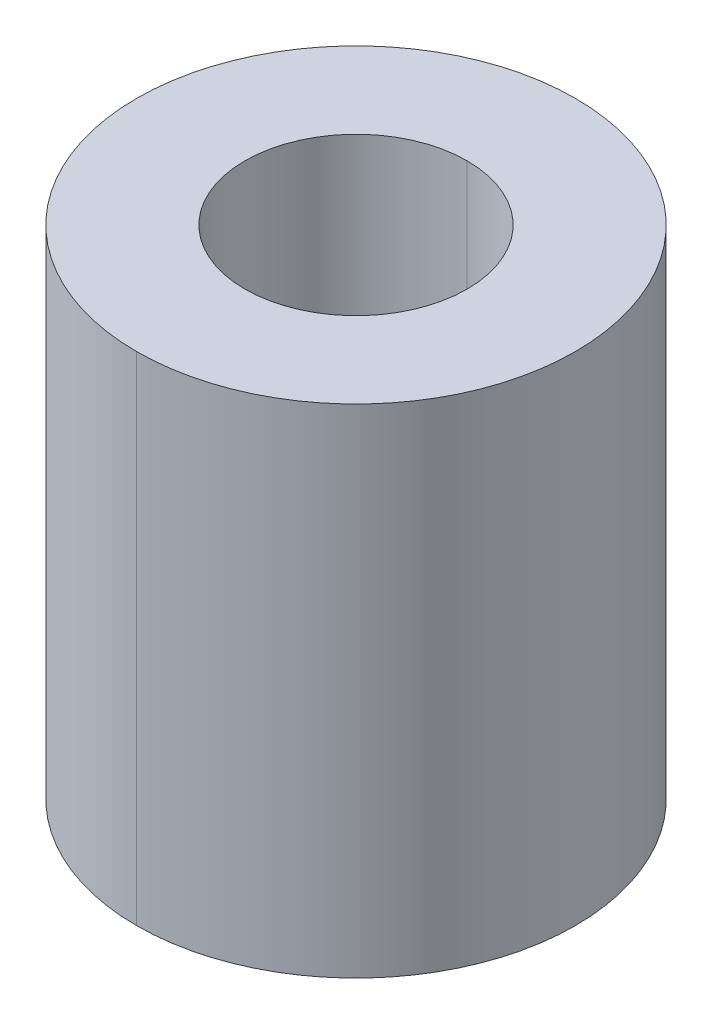
ISO-10303-21;
HEADER;
FILE_DESCRIPTION(('STEP AP214'),'2;1');
FILE_NAME('part.step','',(''),(''),'','','');
FILE_SCHEMA(('AUTOMOTIVE_DESIGN { 1 0 10303 214 1 1 1 1 }'));
ENDSEC;
DATA;
#1=APPLICATION_CONTEXT('core data for automotive mechanical design processes');
#2=APPLICATION_PROTOCOL_DEFINITION('international standard','automotive_design',2000,#1);
#3=PRODUCT_CONTEXT('',#1,'mechanical');
#4=PRODUCT('Part','Part','',(#3));
#5=PRODUCT_RELATED_PRODUCT_CATEGORY('part','',(#4));
#6=PRODUCT_DEFINITION_FORMATION('','',#4);
#7=PRODUCT_DEFINITION_CONTEXT('part definition',#1,'design');
#8=PRODUCT_DEFINITION('design','',#6,#7);
#9=PRODUCT_DEFINITION_SHAPE('','',#8);
#10=(LENGTH_UNIT() NAMED_UNIT(*) SI_UNIT(.MILLI.,.METRE.));
#11=(NAMED_UNIT(*) PLANE_ANGLE_UNIT() SI_UNIT($,.RADIAN.));
#12=(NAMED_UNIT(*) SI_UNIT($,.STERADIAN.) SOLID_ANGLE_UNIT());
#13=UNCERTAINTY_MEASURE_WITH_UNIT(LENGTH_MEASURE(1.E-05),#10,'distance_accuracy_value','');
#14=(GEOMETRIC_REPRESENTATION_CONTEXT(3) GLOBAL_UNCERTAINTY_ASSIGNED_CONTEXT((#13)) GLOBAL_UNIT_ASSIGNED_CONTEXT((#10,
#11,#12)) REPRESENTATION_CONTEXT('',''));
#15=CARTESIAN_POINT('',(0.,0.,0.));
#16=DIRECTION('',(0.,0.,1.));
#17=DIRECTION('',(1.,0.,0.));
#18=AXIS2_PLACEMENT_3D('',#15,#16,#17);
#19=CARTESIAN_POINT('',(0.,21.59,0.));
#20=DIRECTION('',(0.,-1.,0.));
#21=DIRECTION('',(0.,0.,-1.));
#22=AXIS2_PLACEMENT_3D('',#19,#20,#21);
#23=CYLINDRICAL_SURFACE('',#22,4.826);
#24=DIRECTION('',(0.,-1.,0.));
#25=VECTOR('',#24,1.);
#26=CARTESIAN_POINT('',(0.,21.59,4.826));
#27=LINE('',#26,#25);
#28=CARTESIAN_POINT('',(0.,21.59,4.826));
#29=VERTEX_POINT('',#28);
#30=CARTESIAN_POINT('',(0.,0.,4.826));
#31=VERTEX_POINT('',#30);
#32=EDGE_CURVE('E84',#29,#31,#27,.T.);
#33=ORIENTED_EDGE('',*,*,#32,.F.);
#34=CARTESIAN_POINT('',(0.,21.59,0.));
#35=DIRECTION('',(0.,1.,0.));
#36=DIRECTION('',(0.,0.,1.));
#37=AXIS2_PLACEMENT_3D('',#34,#35,#36);
#38=CIRCLE('',#37,4.826);
#39=CARTESIAN_POINT('',(0.,21.59,-4.826));
#40=VERTEX_POINT('',#39);
#41=EDGE_CURVE('E20',#29,#40,#38,.T.);
#42=ORIENTED_EDGE('',*,*,#41,.T.);
#43=DIRECTION('',(0.,-1.,0.));
#44=VECTOR('',#43,1.);
#45=CARTESIAN_POINT('',(0.,21.59,-4.826));
#46=LINE('',#45,#44);
#47=CARTESIAN_POINT('',(0.,0.,-4.826));
#48=VERTEX_POINT('',#47);
#49=EDGE_CURVE('E81',#40,#48,#46,.T.);
#50=ORIENTED_EDGE('',*,*,#49,.T.);
#51=CARTESIAN_POINT('',(0.,0.,0.));
#52=DIRECTION('',(0.,1.,0.));
#53=DIRECTION('',(0.,0.,1.));
#54=AXIS2_PLACEMENT_3D('',#51,#52,#53);
#55=CIRCLE('',#54,4.826);
#56=EDGE_CURVE('E11',#31,#48,#55,.T.);
#57=ORIENTED_EDGE('',*,*,#56,.F.);
#58=EDGE_LOOP('',(#33,#42,#50,#57));
#59=FACE_BOUND('',#58,.T.);
#60=ADVANCED_FACE('F16',(#59),#23,.F.);
#61=CARTESIAN_POINT('',(0.,21.59,0.));
#62=DIRECTION('',(0.,-1.,0.));
#63=DIRECTION('',(0.,0.,-1.));
#64=AXIS2_PLACEMENT_3D('',#61,#62,#63);
#65=CYLINDRICAL_SURFACE('',#64,9.525);
#66=DIRECTION('',(0.,-1.,0.));
#67=VECTOR('',#66,1.);
#68=CARTESIAN_POINT('',(0.,21.59,9.525));
#69=LINE('',#68,#67);
#70=CARTESIAN_POINT('',(0.,21.59,9.525));
#71=VERTEX_POINT('',#70);
#72=CARTESIAN_POINT('',(0.,0.,9.525));
#73=VERTEX_POINT('',#72);
#74=EDGE_CURVE('E111',#71,#73,#69,.T.);
#75=ORIENTED_EDGE('',*,*,#74,.F.);
#76=CARTESIAN_POINT('',(0.,21.59,0.));
#77=DIRECTION('',(0.,1.,0.));
#78=DIRECTION('',(0.,0.,1.));
#79=AXIS2_PLACEMENT_3D('',#76,#77,#78);
#80=CIRCLE('',#79,9.525);
#81=CARTESIAN_POINT('',(0.,21.59,-9.525));
#82=VERTEX_POINT('',#81);
#83=EDGE_CURVE('E54',#82,#71,#80,.T.);
#84=ORIENTED_EDGE('',*,*,#83,.F.);
#85=DIRECTION('',(0.,-1.,0.));
#86=VECTOR('',#85,1.);
#87=CARTESIAN_POINT('',(0.,21.59,-9.525));
#88=LINE('',#87,#86);
#89=CARTESIAN_POINT('',(0.,0.,-9.525));
#90=VERTEX_POINT('',#89);
#91=EDGE_CURVE('E105',#82,#90,#88,.T.);
#92=ORIENTED_EDGE('',*,*,#91,.T.);
#93=CARTESIAN_POINT('',(0.,0.,0.));
#94=DIRECTION('',(0.,1.,0.));
#95=DIRECTION('',(0.,0.,1.));
#96=AXIS2_PLACEMENT_3D('',#93,#94,#95);
#97=CIRCLE('',#96,9.525);
#98=EDGE_CURVE('E27',#90,#73,#97,.T.);
#99=ORIENTED_EDGE('',*,*,#98,.T.);
#100=EDGE_LOOP('',(#75,#84,#92,#99));
#101=FACE_BOUND('',#100,.T.);
#102=ADVANCED_FACE('F18',(#101),#65,.T.);
#103=CARTESIAN_POINT('',(0.,0.,0.));
#104=DIRECTION('',(0.,1.,0.));
#105=DIRECTION('',(1.,0.,0.));
#106=AXIS2_PLACEMENT_3D('',#103,#104,#105);
#107=PLANE('',#106);
#108=CARTESIAN_POINT('',(0.,0.,0.));
#109=DIRECTION('',(0.,1.,0.));
#110=DIRECTION('',(0.,0.,1.));
#111=AXIS2_PLACEMENT_3D('',#108,#109,#110);
#112=CIRCLE('',#111,4.826);
#113=EDGE_CURVE('E92',#48,#31,#112,.T.);
#114=ORIENTED_EDGE('',*,*,#113,.T.);
#115=ORIENTED_EDGE('',*,*,#56,.T.);
#116=EDGE_LOOP('',(#114,#115));
#117=FACE_BOUND('',#116,.T.);
#118=ORIENTED_EDGE('',*,*,#98,.F.);
#119=CARTESIAN_POINT('',(0.,0.,0.));
#120=DIRECTION('',(0.,1.,0.));
#121=DIRECTION('',(0.,0.,1.));
#122=AXIS2_PLACEMENT_3D('',#119,#120,#121);
#123=CIRCLE('',#122,9.525);
#124=EDGE_CURVE('E108',#73,#90,#123,.T.);
#125=ORIENTED_EDGE('',*,*,#124,.F.);
#126=EDGE_LOOP('',(#118,#125));
#127=FACE_BOUND('',#126,.T.);
#128=ADVANCED_FACE('F199',(#117,#127),#107,.F.);
#129=CARTESIAN_POINT('',(0.,21.59,0.));
#130=DIRECTION('',(0.,1.,0.));
#131=DIRECTION('',(1.,0.,0.));
#132=AXIS2_PLACEMENT_3D('',#129,#130,#131);
#133=PLANE('',#132);
#134=CARTESIAN_POINT('',(0.,21.59,0.));
#135=DIRECTION('',(0.,1.,0.));
#136=DIRECTION('',(0.,0.,1.));
#137=AXIS2_PLACEMENT_3D('',#134,#135,#136);
#138=CIRCLE('',#137,4.826);
#139=EDGE_CURVE('E91',#40,#29,#138,.T.);
#140=ORIENTED_EDGE('',*,*,#139,.F.);
#141=ORIENTED_EDGE('',*,*,#41,.F.);
#142=EDGE_LOOP('',(#140,#141));
#143=FACE_BOUND('',#142,.T.);
#144=ORIENTED_EDGE('',*,*,#83,.T.);
#145=CARTESIAN_POINT('',(0.,21.59,0.));
#146=DIRECTION('',(0.,1.,0.));
#147=DIRECTION('',(0.,0.,1.));
#148=AXIS2_PLACEMENT_3D('',#145,#146,#147);
#149=CIRCLE('',#148,9.525);
#150=EDGE_CURVE('E94',#71,#82,#149,.T.);
#151=ORIENTED_EDGE('',*,*,#150,.T.);
#152=EDGE_LOOP('',(#144,#151));
#153=FACE_BOUND('',#152,.T.);
#154=ADVANCED_FACE('F96',(#143,#153),#133,.T.);
#155=CARTESIAN_POINT('',(0.,21.59,0.));
#156=DIRECTION('',(0.,-1.,0.));
#157=DIRECTION('',(0.,0.,-1.));
#158=AXIS2_PLACEMENT_3D('',#155,#156,#157);
#159=CYLINDRICAL_SURFACE('',#158,9.525);
#160=ORIENTED_EDGE('',*,*,#150,.F.);
#161=ORIENTED_EDGE('',*,*,#74,.T.);
#162=ORIENTED_EDGE('',*,*,#124,.T.);
#163=ORIENTED_EDGE('',*,*,#91,.F.);
#164=EDGE_LOOP('',(#160,#161,#162,#163));
#165=FACE_BOUND('',#164,.T.);
#166=ADVANCED_FACE('F176',(#165),#159,.T.);
#167=CARTESIAN_POINT('',(0.,21.59,0.));
#168=DIRECTION('',(0.,-1.,0.));
#169=DIRECTION('',(0.,0.,-1.));
#170=AXIS2_PLACEMENT_3D('',#167,#168,#169);
#171=CYLINDRICAL_SURFACE('',#170,4.826);
#172=ORIENTED_EDGE('',*,*,#139,.T.);
#173=ORIENTED_EDGE('',*,*,#32,.T.);
#174=ORIENTED_EDGE('',*,*,#113,.F.);
#175=ORIENTED_EDGE('',*,*,#49,.F.);
#176=EDGE_LOOP('',(#172,#173,#174,#175));
#177=FACE_BOUND('',#176,.T.);
#178=ADVANCED_FACE('F90',(#177),#171,.F.);
#179=CLOSED_SHELL('',(#60,#102,#128,#154,#166,#178));
#180=MANIFOLD_SOLID_BREP('B1',#179);
#181=ADVANCED_BREP_SHAPE_REPRESENTATION('',(#18,#180),#14);
#182=SHAPE_DEFINITION_REPRESENTATION(#9,#181);
ENDSEC;
END-ISO-10303-21;
